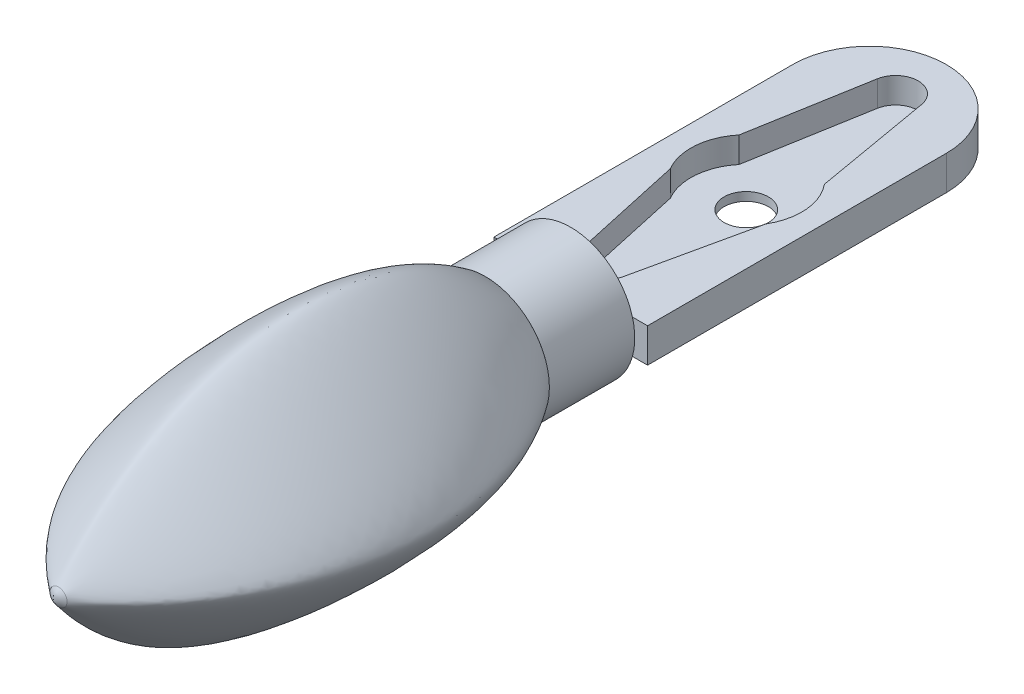
ISO-10303-21;
HEADER;
FILE_DESCRIPTION(('STEP AP214'),'2;1');
FILE_NAME('part.step','',(''),(''),'','','');
FILE_SCHEMA(('AUTOMOTIVE_DESIGN { 1 0 10303 214 1 1 1 1 }'));
ENDSEC;
DATA;
#1=APPLICATION_CONTEXT('core data for automotive mechanical design processes');
#2=APPLICATION_PROTOCOL_DEFINITION('international standard','automotive_design',2000,#1);
#3=PRODUCT_CONTEXT('',#1,'mechanical');
#4=PRODUCT('Part','Part','',(#3));
#5=PRODUCT_RELATED_PRODUCT_CATEGORY('part','',(#4));
#6=PRODUCT_DEFINITION_FORMATION('','',#4);
#7=PRODUCT_DEFINITION_CONTEXT('part definition',#1,'design');
#8=PRODUCT_DEFINITION('design','',#6,#7);
#9=PRODUCT_DEFINITION_SHAPE('','',#8);
#10=(LENGTH_UNIT() NAMED_UNIT(*) SI_UNIT(.MILLI.,.METRE.));
#11=(NAMED_UNIT(*) PLANE_ANGLE_UNIT() SI_UNIT($,.RADIAN.));
#12=(NAMED_UNIT(*) SI_UNIT($,.STERADIAN.) SOLID_ANGLE_UNIT());
#13=UNCERTAINTY_MEASURE_WITH_UNIT(LENGTH_MEASURE(1.E-05),#10,'distance_accuracy_value','');
#14=(GEOMETRIC_REPRESENTATION_CONTEXT(3) GLOBAL_UNCERTAINTY_ASSIGNED_CONTEXT((#13)) GLOBAL_UNIT_ASSIGNED_CONTEXT((#10,
#11,#12)) REPRESENTATION_CONTEXT('',''));
#15=CARTESIAN_POINT('',(0.,0.,0.));
#16=DIRECTION('',(0.,0.,1.));
#17=DIRECTION('',(1.,0.,0.));
#18=AXIS2_PLACEMENT_3D('',#15,#16,#17);
#19=CARTESIAN_POINT('',(10.0199999018431,-3.02000028851811,59.6713058607412));
#20=CARTESIAN_POINT('',(10.0200000172503,-2.61200028851814,59.9359846592579));
#21=CARTESIAN_POINT('',(10.0200001326576,-2.20400028851817,60.045061782606));
#22=CARTESIAN_POINT('',(10.0200002480648,-1.79600028851819,60.045285434479));
#23=CARTESIAN_POINT('',(10.0200003634721,-1.38800028851822,59.9358519810749));
#24=CARTESIAN_POINT('',(10.0200004788793,-0.980000288518246,59.6719841276044));
#25=CARTESIAN_POINT('',(9.81599986377084,-3.02000023081447,59.7611798395393));
#26=CARTESIAN_POINT('',(9.81599997917809,-2.6120002308145,60.0530891284426));
#27=CARTESIAN_POINT('',(9.81600009458533,-2.20400023081453,60.1740586836226));
#28=CARTESIAN_POINT('',(9.81600020999258,-1.79600023081456,60.1746436779478));
#29=CARTESIAN_POINT('',(9.81600032539983,-1.38800023081459,60.0526005432592));
#30=CARTESIAN_POINT('',(9.81600044080708,-0.980000230814612,59.7615503660819));
#31=CARTESIAN_POINT('',(9.6119998256986,-3.02000017311084,59.8452729788772));
#32=CARTESIAN_POINT('',(9.61199994110584,-2.61200017311087,60.1662060321596));
#33=CARTESIAN_POINT('',(9.61200005651309,-2.2040001731109,60.2976076752485));
#34=CARTESIAN_POINT('',(9.61200017192034,-1.79600017311093,60.2987751637316));
#35=CARTESIAN_POINT('',(9.61200028732759,-1.38800017311095,60.1652899757582));
#36=CARTESIAN_POINT('',(9.61200040273484,-0.980000173110978,59.8454013997782));
#37=CARTESIAN_POINT('',(9.40799978762636,-3.0200001154072,59.9296887772695));
#38=CARTESIAN_POINT('',(9.40799990303361,-2.61200011540723,60.2950514761496));
#39=CARTESIAN_POINT('',(9.40800001844085,-2.20400011540726,60.4217271542177));
#40=CARTESIAN_POINT('',(9.4080001338481,-1.79600011540729,60.4215732040455));
#41=CARTESIAN_POINT('',(9.40800024925534,-1.38800011540732,60.2943340917807));
#42=CARTESIAN_POINT('',(9.4080003646626,-0.980000115407343,59.9303294263708));
#43=CARTESIAN_POINT('',(9.16319973224945,-3.02000004616284,59.9906751110089));
#44=CARTESIAN_POINT('',(9.16319984765669,-2.61200004616287,60.4066717478284));
#45=CARTESIAN_POINT('',(9.16319996306394,-2.2040000461629,60.4769060065083));
#46=CARTESIAN_POINT('',(9.16320007847118,-1.79600004616293,60.4823320662432));
#47=CARTESIAN_POINT('',(9.16320019387844,-1.38800004616296,60.4039379670143));
#48=CARTESIAN_POINT('',(9.16320030928569,-0.98000004616298,59.9913886654708));
#49=CARTESIAN_POINT('',(8.91839967687254,-3.01999997691847,59.9786981725399));
#50=CARTESIAN_POINT('',(8.91839979227978,-2.61199997691851,60.3861826542139));
#51=CARTESIAN_POINT('',(8.91839990768704,-2.20399997691853,60.4648540857779));
#52=CARTESIAN_POINT('',(8.91840002309428,-1.79599997691856,60.469162877881));
#53=CARTESIAN_POINT('',(8.91840013850153,-1.38799997691859,60.3839262392396));
#54=CARTESIAN_POINT('',(8.91840025390878,-0.979999976918615,59.9793096431932));
#55=CARTESIAN_POINT('',(8.87759965956787,-3.01999996537775,59.9747084966445));
#56=CARTESIAN_POINT('',(8.87759977497512,-2.61199996537778,60.3791442810936));
#57=CARTESIAN_POINT('',(8.87759989038237,-2.2039999653778,60.4608992058125));
#58=CARTESIAN_POINT('',(8.87760000578961,-1.79599996537783,60.4649246894336));
#59=CARTESIAN_POINT('',(8.87760012119686,-1.38799996537786,60.376982972844));
#60=CARTESIAN_POINT('',(8.87760023660411,-0.979999965377885,59.9753186031182));
#61=CARTESIAN_POINT('',(8.67359962155773,-3.01999990767411,59.9460763977806));
#62=CARTESIAN_POINT('',(8.67359973696498,-2.61199990767414,60.3289409771327));
#63=CARTESIAN_POINT('',(8.67359985237222,-2.20399990767417,60.4302764471199));
#64=CARTESIAN_POINT('',(8.67359996777947,-1.7959999076742,60.4326465825806));
#65=CARTESIAN_POINT('',(8.67360008318672,-1.38799990767423,60.3273728719974));
#66=CARTESIAN_POINT('',(8.67360019859397,-0.97999990767425,59.946609425415));
#67=CARTESIAN_POINT('',(8.46959958354759,-3.01999984997047,59.8788246496406));
#68=CARTESIAN_POINT('',(8.46959969895483,-2.61199984997051,60.2166602439782));
#69=CARTESIAN_POINT('',(8.46959981436209,-2.20399984997054,60.3454706333419));
#70=CARTESIAN_POINT('',(8.46959992976933,-1.79599984997056,60.346190582432));
#71=CARTESIAN_POINT('',(8.46960004517658,-1.38799984997059,60.2158152865172));
#72=CARTESIAN_POINT('',(8.46960016058383,-0.979999849970615,59.8790348028657));
#73=CARTESIAN_POINT('',(8.30639956284212,-3.01999980380757,59.8139327161403));
#74=CARTESIAN_POINT('',(8.30639967824936,-2.6119998038076,60.1215715258685));
#75=CARTESIAN_POINT('',(8.30639979365661,-2.20399980380763,60.2474553097653));
#76=CARTESIAN_POINT('',(8.30639990906386,-1.79599980380766,60.2482160852123));
#77=CARTESIAN_POINT('',(8.30640002447111,-1.38799980380768,60.1209693720613));
#78=CARTESIAN_POINT('',(8.30640013987836,-0.979999803807709,59.814286482078));
#79=CARTESIAN_POINT('',(8.14319954213664,-3.01999975764466,59.7444310830504));
#80=CARTESIAN_POINT('',(8.14319965754389,-2.61199975764469,60.0289009097591));
#81=CARTESIAN_POINT('',(8.14319977295114,-2.20399975764472,60.1489646147589));
#82=CARTESIAN_POINT('',(8.14319988835838,-1.79599975764475,60.1492234588359));
#83=CARTESIAN_POINT('',(8.14320000376564,-1.38799975764478,60.0285716534876));
#84=CARTESIAN_POINT('',(8.14320011917289,-0.979999757644803,59.7450099194435));
#85=CARTESIAN_POINT('',(7.97999952143117,-3.01999971148176,59.6710188183758));
#86=CARTESIAN_POINT('',(7.97999963683842,-2.61199971148179,59.9342651427469));
#87=CARTESIAN_POINT('',(7.97999975224567,-2.20399971148182,60.0461448055459));
#88=CARTESIAN_POINT('',(7.97999986765291,-1.79599971148184,60.0460081890795));
#89=CARTESIAN_POINT('',(7.97999998306017,-1.38799971148187,59.9341338749382));
#90=CARTESIAN_POINT('',(7.98000009846741,-0.979999711481898,59.6718461034298));
#91=B_SPLINE_SURFACE_WITH_KNOTS('',5,5,((#19,#20,#21,#22,#23,#24),(#25,#26,#27,#28,#29,#30),
(#31,#32,#33,#34,#35,#36),(#37,#38,#39,#40,#41,#42),(#43,#44,#45,#46,#47,#48),(#49,#50,#51,#52,
#53,#54),(#55,#56,#57,#58,#59,#60),(#61,#62,#63,#64,#65,#66),(#67,#68,#69,#70,#71,#72),(#73,#74,
#75,#76,#77,#78),(#79,#80,#81,#82,#83,#84),(#85,#86,#87,#88,#89,#90)),.UNSPECIFIED.,.F.,.F.,.F.,
(6,3,3,6),(6,6),(-1.02000024710375,-5.67425053610293E-08,0.204000029780841,1.02000013330824),
(-1.02000000041239,1.01999999958755),.UNSPECIFIED.);
#92=CARTESIAN_POINT('',(9.,-3.00000000000001,60.));
#93=CARTESIAN_POINT('',(8.86910030695214,-3.00000000000001,60.));
#94=CARTESIAN_POINT('',(8.60734891089191,-2.947991074474,60.));
#95=CARTESIAN_POINT('',(8.27446701565593,-2.72553298434406,59.9999999999999));
#96=CARTESIAN_POINT('',(8.05200892552601,-2.39265108910809,60.0000000000001));
#97=CARTESIAN_POINT('',(7.99999999999999,-2.13089969304786,60.));
#98=CARTESIAN_POINT('',(7.99999999999999,-1.86910030695214,60.));
#99=CARTESIAN_POINT('',(8.05200892552601,-1.60734891089191,60.0000000000001));
#100=CARTESIAN_POINT('',(8.27446701565593,-1.27446701565593,59.9999999999998));
#101=CARTESIAN_POINT('',(8.60734891089192,-1.052008925526,60.0000000000001));
#102=CARTESIAN_POINT('',(8.86910030695214,-0.999999999999993,60.));
#103=CARTESIAN_POINT('',(9.13089969304786,-0.999999999999993,60.));
#104=CARTESIAN_POINT('',(9.39265108910809,-1.052008925526,60.));
#105=CARTESIAN_POINT('',(9.72553298434406,-1.27446701565593,60.));
#106=CARTESIAN_POINT('',(9.947991074474,-1.60734891089191,60.0000000000001));
#107=CARTESIAN_POINT('',(10.,-1.86910030695214,60.));
#108=CARTESIAN_POINT('',(10.,-2.13089969304786,60.));
#109=CARTESIAN_POINT('',(9.94799107447399,-2.39265108910809,60.));
#110=CARTESIAN_POINT('',(9.72553298434407,-2.72553298434407,60.));
#111=CARTESIAN_POINT('',(9.39265108910808,-2.947991074474,60.));
#112=CARTESIAN_POINT('',(9.13089969304786,-3.00000000000001,60.));
#113=CARTESIAN_POINT('',(9.,-3.00000000000001,60.));
#114=B_SPLINE_CURVE_WITH_KNOTS('',3,(#92,#93,#94,#95,#96,#97,#98,#99,#100,#101,#102,#103,#104,
#105,#106,#107,#108,#109,#110,#111,#112,#113),.UNSPECIFIED.,.T.,.F.,(4,1,1,1,2,1,1,1,2,1,1,1,2,
1,1,1,4),(0.,0.0625,0.125,0.1875,0.25,0.3125,0.375,0.4375,0.5,0.5625,0.625,0.6875,0.75,0.8125,
0.875,0.9375,1.),.UNSPECIFIED.);
#115=CARTESIAN_POINT('',(9.,-3.00000000000001,60.));
#116=VERTEX_POINT('',#115);
#117=EDGE_CURVE('E141',#116,#116,#114,.T.);
#118=ORIENTED_EDGE('',*,*,#117,.F.);
#119=EDGE_LOOP('',(#118));
#120=FACE_BOUND('',#119,.T.);
#121=ADVANCED_FACE('F128',(#120),#91,.F.);
#122=CARTESIAN_POINT('',(9.,5.5,10.));
#123=DIRECTION('',(0.,0.,-1.));
#124=DIRECTION('',(0.,1.,0.));
#125=AXIS2_PLACEMENT_3D('',#122,#123,#124);
#126=PLANE('',#125);
#127=CARTESIAN_POINT('',(9.,-9.5,10.));
#128=CARTESIAN_POINT('',(9.98174769785895,-9.5,10.));
#129=CARTESIAN_POINT('',(11.9449156493394,-9.10992505068653,10.));
#130=CARTESIAN_POINT('',(14.4414893574974,-7.44148935749734,9.99999999999998));
#131=CARTESIAN_POINT('',(16.1099250506865,-4.94491564933942,10.));
#132=CARTESIAN_POINT('',(16.5,-2.98174769785896,10.));
#133=CARTESIAN_POINT('',(16.5,-1.01825230214104,10.));
#134=CARTESIAN_POINT('',(16.1099250506865,0.944915649339421,10.));
#135=CARTESIAN_POINT('',(14.4414893574973,3.44148935749733,9.99999999999998));
#136=CARTESIAN_POINT('',(11.9449156493394,5.10992505068653,10.));
#137=CARTESIAN_POINT('',(9.98174769785895,5.5,10.));
#138=CARTESIAN_POINT('',(8.01825230214104,5.5,10.));
#139=CARTESIAN_POINT('',(6.05508435066059,5.10992505068652,10.));
#140=CARTESIAN_POINT('',(3.55851064250266,3.44148935749734,9.99999999999998));
#141=CARTESIAN_POINT('',(1.89007494931348,0.94491564933942,10.));
#142=CARTESIAN_POINT('',(1.5,-1.01825230214104,10.));
#143=CARTESIAN_POINT('',(1.5,-2.98174769785896,10.));
#144=CARTESIAN_POINT('',(1.89007494931348,-4.94491564933941,10.));
#145=CARTESIAN_POINT('',(3.55851064250266,-7.44148935749735,9.99999999999999));
#146=CARTESIAN_POINT('',(6.05508435066059,-9.10992505068652,10.));
#147=CARTESIAN_POINT('',(8.01825230214104,-9.5,10.));
#148=CARTESIAN_POINT('',(9.,-9.5,10.));
#149=B_SPLINE_CURVE_WITH_KNOTS('',3,(#127,#128,#129,#130,#131,#132,#133,#134,#135,#136,#137,
#138,#139,#140,#141,#142,#143,#144,#145,#146,#147,#148),.UNSPECIFIED.,.T.,.F.,(4,1,1,1,2,1,1,1,
2,1,1,1,2,1,1,1,4),(0.,0.0625,0.125,0.1875,0.25,0.3125,0.375,0.4375,0.5,0.5625,0.625,0.6875,
0.75,0.8125,0.875,0.9375,1.),.UNSPECIFIED.);
#150=CARTESIAN_POINT('',(9.,-9.5,10.));
#151=VERTEX_POINT('',#150);
#152=EDGE_CURVE('E13',#151,#151,#149,.T.);
#153=ORIENTED_EDGE('',*,*,#152,.F.);
#154=EDGE_LOOP('',(#153));
#155=FACE_BOUND('',#154,.T.);
#156=ADVANCED_FACE('F167',(#155),#126,.T.);
#157=CARTESIAN_POINT('',(9.,-9.5,10.));
#158=CARTESIAN_POINT('',(9.,-13.3872736073307,14.9789819894649));
#159=CARTESIAN_POINT('',(9.,-17.0648639396607,23.7681084370191));
#160=CARTESIAN_POINT('',(9.,-17.1229033941333,36.4134774412373));
#161=CARTESIAN_POINT('',(9.,-13.8336374596375,48.6236967448897));
#162=CARTESIAN_POINT('',(9.,-8.03108860323303,56.1804050979084));
#163=CARTESIAN_POINT('',(9.,-3.00000000000001,60.));
#164=CARTESIAN_POINT('',(9.98174769785895,-9.5,10.));
#165=CARTESIAN_POINT('',(9.88720903065772,-13.3872736073307,14.9789819894649));
#166=CARTESIAN_POINT('',(9.74540102985588,-17.0648639396607,23.7681084370191));
#167=CARTESIAN_POINT('',(9.55632369545341,-17.1229033941333,36.4134774412373));
#168=CARTESIAN_POINT('',(9.36724636105095,-13.8336374596375,48.6236967448897));
#169=CARTESIAN_POINT('',(9.22543836024909,-8.03108860323303,56.1804050979084));
#170=CARTESIAN_POINT('',(9.13089969304786,-3.00000000000001,60.));
#171=CARTESIAN_POINT('',(11.9449156493394,-9.10992505068653,10.));
#172=CARTESIAN_POINT('',(12.2375176768967,-12.458574570855,14.9789819894649));
#173=CARTESIAN_POINT('',(12.4072557083994,-15.597393782275,23.7681084370192));
#174=CARTESIAN_POINT('',(12.0278962934904,-15.5427485324469,36.4134774412373));
#175=CARTESIAN_POINT('',(11.2301237049604,-12.5592110672714,48.6236967448897));
#176=CARTESIAN_POINT('',(10.2148443378712,-7.40290848854873,56.1804050979084));
#177=CARTESIAN_POINT('',(9.39265108910808,-2.947991074474,60.));
#178=CARTESIAN_POINT('',(14.4414893574974,-7.44148935749734,9.99999999999998));
#179=CARTESIAN_POINT('',(16.2222421197012,-9.2222421197012,14.9789819894649));
#180=CARTESIAN_POINT('',(17.816711223674,-10.816711223674,23.7681084370191));
#181=CARTESIAN_POINT('',(17.5199628679874,-10.5199628679874,36.4134774412373));
#182=CARTESIAN_POINT('',(15.5495618178165,-8.54956181781652,48.6236967448896));
#183=CARTESIAN_POINT('',(12.4039613274221,-5.40396132742205,56.1804050979083));
#184=CARTESIAN_POINT('',(9.72553298434407,-2.72553298434407,60.));
#185=CARTESIAN_POINT('',(16.1099250506865,-4.94491564933942,10.));
#186=CARTESIAN_POINT('',(19.458574570855,-5.23751767689672,14.9789819894649));
#187=CARTESIAN_POINT('',(22.597393782275,-5.40725570839941,23.7681084370192));
#188=CARTESIAN_POINT('',(22.5427485324469,-5.02789629349042,36.4134774412373));
#189=CARTESIAN_POINT('',(19.5592110672714,-4.23012370496037,48.6236967448897));
#190=CARTESIAN_POINT('',(14.4029084885487,-3.21484433787125,56.1804050979084));
#191=CARTESIAN_POINT('',(9.94799107447399,-2.39265108910809,60.));
#192=CARTESIAN_POINT('',(16.5,-2.98174769785896,10.));
#193=CARTESIAN_POINT('',(20.3872736073306,-2.88720903065772,14.9789819894649));
#194=CARTESIAN_POINT('',(24.0648639396607,-2.74540102985587,23.7681084370191));
#195=CARTESIAN_POINT('',(24.1229033941333,-2.55632369545341,36.4134774412373));
#196=CARTESIAN_POINT('',(20.8336374596375,-2.36724636105094,48.6236967448897));
#197=CARTESIAN_POINT('',(15.031088603233,-2.22543836024909,56.1804050979084));
#198=CARTESIAN_POINT('',(10.,-2.13089969304786,60.));
#199=CARTESIAN_POINT('',(16.5,-1.01825230214104,10.));
#200=CARTESIAN_POINT('',(20.3872736073306,-1.11279096934228,14.9789819894649));
#201=CARTESIAN_POINT('',(24.0648639396607,-1.25459897014413,23.7681084370191));
#202=CARTESIAN_POINT('',(24.1229033941333,-1.44367630454659,36.4134774412373));
#203=CARTESIAN_POINT('',(20.8336374596375,-1.63275363894906,48.6236967448897));
#204=CARTESIAN_POINT('',(15.031088603233,-1.77456163975091,56.1804050979084));
#205=CARTESIAN_POINT('',(10.,-1.86910030695214,60.));
#206=CARTESIAN_POINT('',(16.1099250506865,0.944915649339421,10.));
#207=CARTESIAN_POINT('',(19.458574570855,1.23751767689672,14.9789819894649));
#208=CARTESIAN_POINT('',(22.597393782275,1.40725570839942,23.7681084370192));
#209=CARTESIAN_POINT('',(22.5427485324469,1.02789629349042,36.4134774412374));
#210=CARTESIAN_POINT('',(19.5592110672714,0.230123704960372,48.6236967448897));
#211=CARTESIAN_POINT('',(14.4029084885487,-0.785155662128749,56.1804050979084));
#212=CARTESIAN_POINT('',(9.947991074474,-1.60734891089191,60.0000000000001));
#213=CARTESIAN_POINT('',(14.4414893574973,3.44148935749733,9.99999999999998));
#214=CARTESIAN_POINT('',(16.2222421197012,5.2222421197012,14.9789819894649));
#215=CARTESIAN_POINT('',(17.816711223674,6.81671122367401,23.7681084370191));
#216=CARTESIAN_POINT('',(17.5199628679873,6.51996286798737,36.4134774412373));
#217=CARTESIAN_POINT('',(15.5495618178165,4.54956181781652,48.6236967448896));
#218=CARTESIAN_POINT('',(12.403961327422,1.40396132742205,56.1804050979083));
#219=CARTESIAN_POINT('',(9.72553298434406,-1.27446701565593,60.));
#220=CARTESIAN_POINT('',(11.9449156493394,5.10992505068653,10.));
#221=CARTESIAN_POINT('',(12.2375176768967,8.45857457085503,14.9789819894649));
#222=CARTESIAN_POINT('',(12.4072557083994,11.5973937822751,23.7681084370192));
#223=CARTESIAN_POINT('',(12.0278962934904,11.5427485324469,36.4134774412373));
#224=CARTESIAN_POINT('',(11.2301237049604,8.55921106727144,48.6236967448897));
#225=CARTESIAN_POINT('',(10.2148443378713,3.40290848854873,56.1804050979084));
#226=CARTESIAN_POINT('',(9.39265108910809,-1.052008925526,60.));
#227=CARTESIAN_POINT('',(9.98174769785895,5.5,10.));
#228=CARTESIAN_POINT('',(9.88720903065772,9.38727360733067,14.9789819894649));
#229=CARTESIAN_POINT('',(9.74540102985588,13.0648639396607,23.7681084370192));
#230=CARTESIAN_POINT('',(9.55632369545341,13.1229033941334,36.4134774412373));
#231=CARTESIAN_POINT('',(9.36724636105095,9.83363745963754,48.6236967448897));
#232=CARTESIAN_POINT('',(9.22543836024909,4.03108860323302,56.1804050979084));
#233=CARTESIAN_POINT('',(9.13089969304786,-0.999999999999993,60.));
#234=CARTESIAN_POINT('',(8.01825230214104,5.5,10.));
#235=CARTESIAN_POINT('',(8.11279096934227,9.38727360733067,14.9789819894649));
#236=CARTESIAN_POINT('',(8.25459897014413,13.0648639396607,23.7681084370192));
#237=CARTESIAN_POINT('',(8.44367630454659,13.1229033941334,36.4134774412373));
#238=CARTESIAN_POINT('',(8.63275363894906,9.83363745963754,48.6236967448897));
#239=CARTESIAN_POINT('',(8.7745616397509,4.03108860323302,56.1804050979084));
#240=CARTESIAN_POINT('',(8.86910030695214,-0.999999999999993,60.));
#241=CARTESIAN_POINT('',(6.05508435066059,5.10992505068652,10.));
#242=CARTESIAN_POINT('',(5.76248232310329,8.45857457085503,14.978981989465));
#243=CARTESIAN_POINT('',(5.5927442916006,11.5973937822751,23.7681084370192));
#244=CARTESIAN_POINT('',(5.97210370650959,11.5427485324469,36.4134774412374));
#245=CARTESIAN_POINT('',(6.76987629503964,8.55921106727143,48.6236967448898));
#246=CARTESIAN_POINT('',(7.78515566212876,3.40290848854873,56.1804050979085));
#247=CARTESIAN_POINT('',(8.60734891089192,-1.052008925526,60.0000000000001));
#248=CARTESIAN_POINT('',(3.55851064250266,3.44148935749734,9.99999999999998));
#249=CARTESIAN_POINT('',(1.7777578802988,5.2222421197012,14.9789819894649));
#250=CARTESIAN_POINT('',(0.183288776326013,6.81671122367401,23.7681084370191));
#251=CARTESIAN_POINT('',(0.480037132012637,6.51996286798738,36.4134774412372));
#252=CARTESIAN_POINT('',(2.45043818218349,4.54956181781652,48.6236967448895));
#253=CARTESIAN_POINT('',(5.59603867257794,1.40396132742205,56.1804050979082));
#254=CARTESIAN_POINT('',(8.27446701565593,-1.27446701565593,59.9999999999998));
#255=CARTESIAN_POINT('',(1.89007494931348,0.94491564933942,10.));
#256=CARTESIAN_POINT('',(-1.45857457085501,1.23751767689672,14.9789819894649));
#257=CARTESIAN_POINT('',(-4.59739378227501,1.40725570839942,23.7681084370192));
#258=CARTESIAN_POINT('',(-4.5427485324469,1.02789629349042,36.4134774412374));
#259=CARTESIAN_POINT('',(-1.5592110672714,0.23012370496037,48.6236967448897));
#260=CARTESIAN_POINT('',(3.59709151145128,-0.785155662128749,56.1804050979084));
#261=CARTESIAN_POINT('',(8.05200892552601,-1.60734891089191,60.0000000000001));
#262=CARTESIAN_POINT('',(1.5,-1.01825230214104,10.));
#263=CARTESIAN_POINT('',(-2.38727360733066,-1.11279096934228,14.9789819894649));
#264=CARTESIAN_POINT('',(-6.06486393966067,-1.25459897014413,23.7681084370191));
#265=CARTESIAN_POINT('',(-6.12290339413331,-1.44367630454659,36.4134774412373));
#266=CARTESIAN_POINT('',(-2.83363745963751,-1.63275363894906,48.6236967448897));
#267=CARTESIAN_POINT('',(2.96891139676698,-1.77456163975091,56.1804050979083));
#268=CARTESIAN_POINT('',(7.99999999999999,-1.86910030695214,60.));
#269=CARTESIAN_POINT('',(1.5,-2.98174769785896,10.));
#270=CARTESIAN_POINT('',(-2.38727360733066,-2.88720903065772,14.9789819894649));
#271=CARTESIAN_POINT('',(-6.06486393966067,-2.74540102985587,23.7681084370191));
#272=CARTESIAN_POINT('',(-6.12290339413331,-2.55632369545341,36.4134774412373));
#273=CARTESIAN_POINT('',(-2.83363745963751,-2.36724636105094,48.6236967448897));
#274=CARTESIAN_POINT('',(2.96891139676698,-2.22543836024909,56.1804050979083));
#275=CARTESIAN_POINT('',(7.99999999999999,-2.13089969304786,60.));
#276=CARTESIAN_POINT('',(1.89007494931348,-4.94491564933941,10.));
#277=CARTESIAN_POINT('',(-1.45857457085501,-5.23751767689671,14.9789819894649));
#278=CARTESIAN_POINT('',(-4.59739378227501,-5.40725570839941,23.7681084370192));
#279=CARTESIAN_POINT('',(-4.5427485324469,-5.02789629349042,36.4134774412374));
#280=CARTESIAN_POINT('',(-1.5592110672714,-4.23012370496037,48.6236967448897));
#281=CARTESIAN_POINT('',(3.59709151145129,-3.21484433787126,56.1804050979084));
#282=CARTESIAN_POINT('',(8.05200892552601,-2.39265108910809,60.0000000000001));
#283=CARTESIAN_POINT('',(3.55851064250266,-7.44148935749735,9.99999999999999));
#284=CARTESIAN_POINT('',(1.7777578802988,-9.2222421197012,14.9789819894649));
#285=CARTESIAN_POINT('',(0.183288776326013,-10.816711223674,23.7681084370191));
#286=CARTESIAN_POINT('',(0.480037132012639,-10.5199628679874,36.4134774412373));
#287=CARTESIAN_POINT('',(2.45043818218349,-8.54956181781652,48.6236967448896));
#288=CARTESIAN_POINT('',(5.59603867257795,-5.40396132742205,56.1804050979083));
#289=CARTESIAN_POINT('',(8.27446701565593,-2.72553298434406,59.9999999999999));
#290=CARTESIAN_POINT('',(6.05508435066059,-9.10992505068652,10.));
#291=CARTESIAN_POINT('',(5.76248232310329,-12.458574570855,14.9789819894649));
#292=CARTESIAN_POINT('',(5.5927442916006,-15.597393782275,23.7681084370192));
#293=CARTESIAN_POINT('',(5.97210370650959,-15.5427485324469,36.4134774412373));
#294=CARTESIAN_POINT('',(6.76987629503964,-12.5592110672714,48.6236967448897));
#295=CARTESIAN_POINT('',(7.78515566212875,-7.40290848854873,56.1804050979084));
#296=CARTESIAN_POINT('',(8.60734891089191,-2.947991074474,60.));
#297=CARTESIAN_POINT('',(8.01825230214104,-9.5,10.));
#298=CARTESIAN_POINT('',(8.11279096934227,-13.3872736073307,14.9789819894649));
#299=CARTESIAN_POINT('',(8.25459897014413,-17.0648639396607,23.7681084370191));
#300=CARTESIAN_POINT('',(8.44367630454659,-17.1229033941333,36.4134774412373));
#301=CARTESIAN_POINT('',(8.63275363894906,-13.8336374596375,48.6236967448897));
#302=CARTESIAN_POINT('',(8.7745616397509,-8.03108860323303,56.1804050979084));
#303=CARTESIAN_POINT('',(8.86910030695214,-3.00000000000001,60.));
#304=CARTESIAN_POINT('',(9.,-9.5,10.));
#305=CARTESIAN_POINT('',(9.,-13.3872736073307,14.9789819894649));
#306=CARTESIAN_POINT('',(9.,-17.0648639396607,23.7681084370191));
#307=CARTESIAN_POINT('',(9.,-17.1229033941333,36.4134774412373));
#308=CARTESIAN_POINT('',(9.,-13.8336374596375,48.6236967448897));
#309=CARTESIAN_POINT('',(9.,-8.03108860323303,56.1804050979084));
#310=CARTESIAN_POINT('',(9.,-3.00000000000001,60.));
#311=B_SPLINE_SURFACE_WITH_KNOTS('',3,3,((#157,#158,#159,#160,#161,#162,#163),(#164,#165,#166,
#167,#168,#169,#170),(#171,#172,#173,#174,#175,#176,#177),(#178,#179,#180,#181,#182,#183,#184),
(#185,#186,#187,#188,#189,#190,#191),(#192,#193,#194,#195,#196,#197,#198),(#199,#200,#201,#202,
#203,#204,#205),(#206,#207,#208,#209,#210,#211,#212),(#213,#214,#215,#216,#217,#218,#219),(#220,
#221,#222,#223,#224,#225,#226),(#227,#228,#229,#230,#231,#232,#233),(#234,#235,#236,#237,#238,
#239,#240),(#241,#242,#243,#244,#245,#246,#247),(#248,#249,#250,#251,#252,#253,#254),(#255,#256,
#257,#258,#259,#260,#261),(#262,#263,#264,#265,#266,#267,#268),(#269,#270,#271,#272,#273,#274,
#275),(#276,#277,#278,#279,#280,#281,#282),(#283,#284,#285,#286,#287,#288,#289),(#290,#291,#292,
#293,#294,#295,#296),(#297,#298,#299,#300,#301,#302,#303),(#304,#305,#306,#307,#308,#309,#310)),
.UNSPECIFIED.,.T.,.F.,.F.,(4,1,1,1,2,1,1,1,2,1,1,1,2,1,1,1,4),(4,1,1,1,4),(0.,0.0625,0.125,
0.1875,0.25,0.3125,0.375,0.4375,0.5,0.5625,0.625,0.6875,0.75,0.8125,0.875,0.9375,1.),(0.,
0.333333333333333,0.5,0.666666666666667,1.),.UNSPECIFIED.);
#312=ORIENTED_EDGE('',*,*,#152,.T.);
#313=EDGE_LOOP('',(#312));
#314=FACE_BOUND('',#313,.T.);
#315=ORIENTED_EDGE('',*,*,#117,.T.);
#316=EDGE_LOOP('',(#315));
#317=FACE_BOUND('',#316,.T.);
#318=ADVANCED_FACE('F165',(#314,#317),#311,.T.);
#319=CLOSED_SHELL('',(#121,#156,#318));
#320=MANIFOLD_SOLID_BREP('B2',#319);
#321=CARTESIAN_POINT('',(18.,-4.,0.));
#322=DIRECTION('',(0.,0.,-1.));
#323=DIRECTION('',(-1.,0.,0.));
#324=AXIS2_PLACEMENT_3D('',#321,#322,#323);
#325=PLANE('',#324);
#326=CARTESIAN_POINT('',(9.,-2.,0.));
#327=DIRECTION('',(0.,0.,1.));
#328=DIRECTION('',(1.,0.,0.));
#329=AXIS2_PLACEMENT_3D('',#326,#327,#328);
#330=CIRCLE('',#329,7.5);
#331=CARTESIAN_POINT('',(1.77158385259952,0.,0.));
#332=VERTEX_POINT('',#331);
#333=CARTESIAN_POINT('',(1.77158385259952,-4.,0.));
#334=VERTEX_POINT('',#333);
#335=EDGE_CURVE('E126',#332,#334,#330,.T.);
#336=ORIENTED_EDGE('',*,*,#335,.F.);
#337=DIRECTION('',(-1.,0.,0.));
#338=VECTOR('',#337,1.);
#339=CARTESIAN_POINT('',(18.,0.,0.));
#340=LINE('',#339,#338);
#341=CARTESIAN_POINT('',(0.,0.,0.));
#342=VERTEX_POINT('',#341);
#343=EDGE_CURVE('E333',#332,#342,#340,.T.);
#344=ORIENTED_EDGE('',*,*,#343,.T.);
#345=DIRECTION('',(0.,1.,0.));
#346=VECTOR('',#345,1.);
#347=CARTESIAN_POINT('',(0.,-4.,0.));
#348=LINE('',#347,#346);
#349=CARTESIAN_POINT('',(0.,-4.,0.));
#350=VERTEX_POINT('',#349);
#351=EDGE_CURVE('E346',#350,#342,#348,.T.);
#352=ORIENTED_EDGE('',*,*,#351,.F.);
#353=DIRECTION('',(-1.,0.,0.));
#354=VECTOR('',#353,1.);
#355=CARTESIAN_POINT('',(18.,-4.,0.));
#356=LINE('',#355,#354);
#357=EDGE_CURVE('E239',#334,#350,#356,.T.);
#358=ORIENTED_EDGE('',*,*,#357,.F.);
#359=EDGE_LOOP('',(#336,#344,#352,#358));
#360=FACE_BOUND('',#359,.T.);
#361=ADVANCED_FACE('F221',(#360),#325,.F.);
#362=CARTESIAN_POINT('',(16.2284161474005,-4.,0.));
#363=VERTEX_POINT('',#362);
#364=CARTESIAN_POINT('',(16.2284161474005,0.,0.));
#365=VERTEX_POINT('',#364);
#366=EDGE_CURVE('E230',#363,#365,#330,.T.);
#367=ORIENTED_EDGE('',*,*,#366,.F.);
#368=CARTESIAN_POINT('',(18.,-4.,0.));
#369=VERTEX_POINT('',#368);
#370=EDGE_CURVE('E417',#369,#363,#356,.T.);
#371=ORIENTED_EDGE('',*,*,#370,.F.);
#372=DIRECTION('',(0.,1.,0.));
#373=VECTOR('',#372,1.);
#374=CARTESIAN_POINT('',(18.,-4.,0.));
#375=LINE('',#374,#373);
#376=CARTESIAN_POINT('',(18.,0.,0.));
#377=VERTEX_POINT('',#376);
#378=EDGE_CURVE('E327',#369,#377,#375,.T.);
#379=ORIENTED_EDGE('',*,*,#378,.T.);
#380=EDGE_CURVE('E324',#377,#365,#340,.T.);
#381=ORIENTED_EDGE('',*,*,#380,.T.);
#382=EDGE_LOOP('',(#367,#371,#379,#381));
#383=FACE_BOUND('',#382,.T.);
#384=ADVANCED_FACE('F223',(#383),#325,.F.);
#385=CARTESIAN_POINT('',(0.,-4.,0.));
#386=DIRECTION('',(1.,0.,0.));
#387=DIRECTION('',(0.,0.,-1.));
#388=AXIS2_PLACEMENT_3D('',#385,#386,#387);
#389=PLANE('',#388);
#390=DIRECTION('',(0.,0.,-1.));
#391=VECTOR('',#390,1.);
#392=CARTESIAN_POINT('',(0.,0.,0.));
#393=LINE('',#392,#391);
#394=CARTESIAN_POINT('',(0.,0.,-35.));
#395=VERTEX_POINT('',#394);
#396=EDGE_CURVE('E330',#342,#395,#393,.T.);
#397=ORIENTED_EDGE('',*,*,#396,.T.);
#398=DIRECTION('',(0.,1.,0.));
#399=VECTOR('',#398,1.);
#400=CARTESIAN_POINT('',(0.,-4.,-35.));
#401=LINE('',#400,#399);
#402=CARTESIAN_POINT('',(0.,-4.,-35.));
#403=VERTEX_POINT('',#402);
#404=EDGE_CURVE('E435',#403,#395,#401,.T.);
#405=ORIENTED_EDGE('',*,*,#404,.F.);
#406=DIRECTION('',(0.,0.,-1.));
#407=VECTOR('',#406,1.);
#408=CARTESIAN_POINT('',(0.,-4.,0.));
#409=LINE('',#408,#407);
#410=EDGE_CURVE('E419',#350,#403,#409,.T.);
#411=ORIENTED_EDGE('',*,*,#410,.F.);
#412=ORIENTED_EDGE('',*,*,#351,.T.);
#413=EDGE_LOOP('',(#397,#405,#411,#412));
#414=FACE_BOUND('',#413,.T.);
#415=ADVANCED_FACE('F440',(#414),#389,.F.);
#416=CARTESIAN_POINT('',(9.,-4.,-35.));
#417=DIRECTION('',(0.,1.,0.));
#418=DIRECTION('',(0.,0.,1.));
#419=AXIS2_PLACEMENT_3D('',#416,#417,#418);
#420=CYLINDRICAL_SURFACE('',#419,9.);
#421=CARTESIAN_POINT('',(9.,0.,-35.));
#422=DIRECTION('',(0.,-1.,0.));
#423=DIRECTION('',(0.,0.,-1.));
#424=AXIS2_PLACEMENT_3D('',#421,#422,#423);
#425=CIRCLE('',#424,9.);
#426=CARTESIAN_POINT('',(18.,0.,-35.));
#427=VERTEX_POINT('',#426);
#428=EDGE_CURVE('E427',#395,#427,#425,.T.);
#429=ORIENTED_EDGE('',*,*,#428,.T.);
#430=DIRECTION('',(0.,1.,0.));
#431=VECTOR('',#430,1.);
#432=CARTESIAN_POINT('',(18.,-4.,-35.));
#433=LINE('',#432,#431);
#434=CARTESIAN_POINT('',(18.,-4.,-35.));
#435=VERTEX_POINT('',#434);
#436=EDGE_CURVE('E432',#435,#427,#433,.T.);
#437=ORIENTED_EDGE('',*,*,#436,.F.);
#438=CARTESIAN_POINT('',(9.,-4.,-35.));
#439=DIRECTION('',(0.,-1.,0.));
#440=DIRECTION('',(0.,0.,-1.));
#441=AXIS2_PLACEMENT_3D('',#438,#439,#440);
#442=CIRCLE('',#441,9.);
#443=EDGE_CURVE('E422',#403,#435,#442,.T.);
#444=ORIENTED_EDGE('',*,*,#443,.F.);
#445=ORIENTED_EDGE('',*,*,#404,.T.);
#446=EDGE_LOOP('',(#429,#437,#444,#445));
#447=FACE_BOUND('',#446,.T.);
#448=ADVANCED_FACE('F445',(#447),#420,.T.);
#449=CARTESIAN_POINT('',(18.,-4.,-35.));
#450=DIRECTION('',(-1.,0.,0.));
#451=DIRECTION('',(0.,0.,1.));
#452=AXIS2_PLACEMENT_3D('',#449,#450,#451);
#453=PLANE('',#452);
#454=DIRECTION('',(0.,0.,1.));
#455=VECTOR('',#454,1.);
#456=CARTESIAN_POINT('',(18.,0.,-35.));
#457=LINE('',#456,#455);
#458=EDGE_CURVE('E429',#427,#377,#457,.T.);
#459=ORIENTED_EDGE('',*,*,#458,.T.);
#460=ORIENTED_EDGE('',*,*,#378,.F.);
#461=DIRECTION('',(0.,0.,1.));
#462=VECTOR('',#461,1.);
#463=CARTESIAN_POINT('',(18.,-4.,-35.));
#464=LINE('',#463,#462);
#465=EDGE_CURVE('E424',#435,#369,#464,.T.);
#466=ORIENTED_EDGE('',*,*,#465,.F.);
#467=ORIENTED_EDGE('',*,*,#436,.T.);
#468=EDGE_LOOP('',(#459,#460,#466,#467));
#469=FACE_BOUND('',#468,.T.);
#470=ADVANCED_FACE('F449',(#469),#453,.F.);
#471=CARTESIAN_POINT('',(9.,-4.,-35.));
#472=DIRECTION('',(0.,-1.,0.));
#473=DIRECTION('',(0.,0.,-1.));
#474=AXIS2_PLACEMENT_3D('',#471,#472,#473);
#475=PLANE('',#474);
#476=CARTESIAN_POINT('',(9.,-4.,-20.5602345410471));
#477=DIRECTION('',(0.,1.,0.));
#478=DIRECTION('',(0.,0.,1.));
#479=AXIS2_PLACEMENT_3D('',#476,#477,#478);
#480=CIRCLE('',#479,2.6);
#481=CARTESIAN_POINT('',(9.,-4.,-17.9602345410471));
#482=VERTEX_POINT('',#481);
#483=EDGE_CURVE('E350',#482,#482,#480,.T.);
#484=ORIENTED_EDGE('',*,*,#483,.T.);
#485=EDGE_LOOP('',(#484));
#486=FACE_BOUND('',#485,.T.);
#487=ORIENTED_EDGE('',*,*,#370,.T.);
#488=EDGE_CURVE('E420',#363,#334,#356,.T.);
#489=ORIENTED_EDGE('',*,*,#488,.T.);
#490=ORIENTED_EDGE('',*,*,#357,.T.);
#491=ORIENTED_EDGE('',*,*,#410,.T.);
#492=ORIENTED_EDGE('',*,*,#443,.T.);
#493=ORIENTED_EDGE('',*,*,#465,.T.);
#494=EDGE_LOOP('',(#487,#489,#490,#491,#492,#493));
#495=FACE_BOUND('',#494,.T.);
#496=ADVANCED_FACE('F451',(#486,#495),#475,.T.);
#497=CARTESIAN_POINT('',(9.,0.,-35.));
#498=DIRECTION('',(0.,-1.,0.));
#499=DIRECTION('',(0.,0.,-1.));
#500=AXIS2_PLACEMENT_3D('',#497,#498,#499);
#501=PLANE('',#500);
#502=DIRECTION('',(-0.171428571428571,0.,0.98519655140381));
#503=VECTOR('',#502,1.);
#504=CARTESIAN_POINT('',(6.4,0.,-38.5062981921595));
#505=LINE('',#504,#503);
#506=CARTESIAN_POINT('',(6.4,0.,-38.5062981921595));
#507=VERTEX_POINT('',#506);
#508=CARTESIAN_POINT('',(4.,0.,-24.7135464725062));
#509=VERTEX_POINT('',#508);
#510=EDGE_CURVE('E381',#507,#509,#505,.T.);
#511=ORIENTED_EDGE('',*,*,#510,.F.);
#512=CARTESIAN_POINT('',(9.,0.,-38.0538866555182));
#513=DIRECTION('',(0.,1.,0.));
#514=DIRECTION('',(0.,0.,1.));
#515=AXIS2_PLACEMENT_3D('',#512,#513,#514);
#516=CIRCLE('',#515,2.63906729707412);
#517=CARTESIAN_POINT('',(11.6,0.,-38.5062981921595));
#518=VERTEX_POINT('',#517);
#519=EDGE_CURVE('E379',#518,#507,#516,.T.);
#520=ORIENTED_EDGE('',*,*,#519,.F.);
#521=DIRECTION('',(0.171428571428572,0.,0.98519655140381));
#522=VECTOR('',#521,1.);
#523=CARTESIAN_POINT('',(11.6,0.,-38.5062981921595));
#524=LINE('',#523,#522);
#525=CARTESIAN_POINT('',(14.,0.,-24.7135464725062));
#526=VERTEX_POINT('',#525);
#527=EDGE_CURVE('E359',#518,#526,#524,.T.);
#528=ORIENTED_EDGE('',*,*,#527,.T.);
#529=CARTESIAN_POINT('',(9.,0.,-20.5602345410471));
#530=DIRECTION('',(0.,1.,0.));
#531=DIRECTION('',(0.,0.,1.));
#532=AXIS2_PLACEMENT_3D('',#529,#530,#531);
#533=CIRCLE('',#532,6.5);
#534=CARTESIAN_POINT('',(14.6028914192137,0.,-17.2651461136295));
#535=VERTEX_POINT('',#534);
#536=EDGE_CURVE('E396',#535,#526,#533,.T.);
#537=ORIENTED_EDGE('',*,*,#536,.F.);
#538=DIRECTION('',(-0.214492244229548,0.,0.976725691873298));
#539=VECTOR('',#538,1.);
#540=CARTESIAN_POINT('',(14.6028914192137,0.,-17.2651461136295));
#541=LINE('',#540,#539);
#542=CARTESIAN_POINT('',(11.6,0.,-3.59098642740331));
#543=VERTEX_POINT('',#542);
#544=EDGE_CURVE('E393',#535,#543,#541,.T.);
#545=ORIENTED_EDGE('',*,*,#544,.T.);
#546=CARTESIAN_POINT('',(9.,0.,-4.16195516472323));
#547=DIRECTION('',(0.,1.,0.));
#548=DIRECTION('',(0.,0.,1.));
#549=AXIS2_PLACEMENT_3D('',#546,#547,#548);
#550=CIRCLE('',#549,2.66195516472323);
#551=CARTESIAN_POINT('',(6.4,0.,-3.59098642740331));
#552=VERTEX_POINT('',#551);
#553=EDGE_CURVE('E390',#552,#543,#550,.T.);
#554=ORIENTED_EDGE('',*,*,#553,.F.);
#555=DIRECTION('',(0.214492244229548,0.,0.976725691873297));
#556=VECTOR('',#555,1.);
#557=CARTESIAN_POINT('',(3.39710858078633,0.,-17.2651461136295));
#558=LINE('',#557,#556);
#559=CARTESIAN_POINT('',(3.39710858078633,0.,-17.2651461136295));
#560=VERTEX_POINT('',#559);
#561=EDGE_CURVE('E387',#560,#552,#558,.T.);
#562=ORIENTED_EDGE('',*,*,#561,.F.);
#563=CARTESIAN_POINT('',(9.,0.,-20.5602345410471));
#564=DIRECTION('',(0.,1.,0.));
#565=DIRECTION('',(0.,0.,1.));
#566=AXIS2_PLACEMENT_3D('',#563,#564,#565);
#567=CIRCLE('',#566,6.5);
#568=EDGE_CURVE('E384',#509,#560,#567,.T.);
#569=ORIENTED_EDGE('',*,*,#568,.F.);
#570=EDGE_LOOP('',(#511,#520,#528,#537,#545,#554,#562,#569));
#571=FACE_BOUND('',#570,.T.);
#572=ORIENTED_EDGE('',*,*,#380,.F.);
#573=ORIENTED_EDGE('',*,*,#458,.F.);
#574=ORIENTED_EDGE('',*,*,#428,.F.);
#575=ORIENTED_EDGE('',*,*,#396,.F.);
#576=ORIENTED_EDGE('',*,*,#343,.F.);
#577=EDGE_CURVE('E331',#365,#332,#340,.T.);
#578=ORIENTED_EDGE('',*,*,#577,.F.);
#579=EDGE_LOOP('',(#572,#573,#574,#575,#576,#578));
#580=FACE_BOUND('',#579,.T.);
#581=ADVANCED_FACE('F336',(#571,#580),#501,.F.);
#582=CARTESIAN_POINT('',(9.,-3.,-38.0538866555182));
#583=DIRECTION('',(0.,1.,0.));
#584=DIRECTION('',(0.,0.,1.));
#585=AXIS2_PLACEMENT_3D('',#582,#583,#584);
#586=CYLINDRICAL_SURFACE('',#585,2.63906729707412);
#587=ORIENTED_EDGE('',*,*,#519,.T.);
#588=DIRECTION('',(0.,1.,0.));
#589=VECTOR('',#588,1.);
#590=CARTESIAN_POINT('',(6.4,-3.,-38.5062981921595));
#591=LINE('',#590,#589);
#592=CARTESIAN_POINT('',(6.4,-3.,-38.5062981921595));
#593=VERTEX_POINT('',#592);
#594=EDGE_CURVE('E378',#593,#507,#591,.T.);
#595=ORIENTED_EDGE('',*,*,#594,.F.);
#596=CARTESIAN_POINT('',(9.,-3.,-38.0538866555182));
#597=DIRECTION('',(0.,1.,0.));
#598=DIRECTION('',(0.,0.,1.));
#599=AXIS2_PLACEMENT_3D('',#596,#597,#598);
#600=CIRCLE('',#599,2.63906729707412);
#601=CARTESIAN_POINT('',(11.6,-3.,-38.5062981921595));
#602=VERTEX_POINT('',#601);
#603=EDGE_CURVE('E355',#602,#593,#600,.T.);
#604=ORIENTED_EDGE('',*,*,#603,.F.);
#605=DIRECTION('',(0.,1.,0.));
#606=VECTOR('',#605,1.);
#607=CARTESIAN_POINT('',(11.6,-3.,-38.5062981921595));
#608=LINE('',#607,#606);
#609=EDGE_CURVE('E401',#602,#518,#608,.T.);
#610=ORIENTED_EDGE('',*,*,#609,.T.);
#611=EDGE_LOOP('',(#587,#595,#604,#610));
#612=FACE_BOUND('',#611,.T.);
#613=ADVANCED_FACE('F482',(#612),#586,.F.);
#614=CARTESIAN_POINT('',(11.6,-3.,-38.5062981921595));
#615=DIRECTION('',(-0.985196551403809,0.,0.171428571428572));
#616=DIRECTION('',(0.171428571428572,0.,0.98519655140381));
#617=AXIS2_PLACEMENT_3D('',#614,#615,#616);
#618=PLANE('',#617);
#619=ORIENTED_EDGE('',*,*,#527,.F.);
#620=ORIENTED_EDGE('',*,*,#609,.F.);
#621=DIRECTION('',(0.171428571428572,0.,0.98519655140381));
#622=VECTOR('',#621,1.);
#623=CARTESIAN_POINT('',(11.6,-3.,-38.5062981921595));
#624=LINE('',#623,#622);
#625=CARTESIAN_POINT('',(14.,-3.,-24.7135464725062));
#626=VERTEX_POINT('',#625);
#627=EDGE_CURVE('E376',#602,#626,#624,.T.);
#628=ORIENTED_EDGE('',*,*,#627,.T.);
#629=DIRECTION('',(0.,1.,0.));
#630=VECTOR('',#629,1.);
#631=CARTESIAN_POINT('',(14.,-3.,-24.7135464725062));
#632=LINE('',#631,#630);
#633=EDGE_CURVE('E403',#626,#526,#632,.T.);
#634=ORIENTED_EDGE('',*,*,#633,.T.);
#635=EDGE_LOOP('',(#619,#620,#628,#634));
#636=FACE_BOUND('',#635,.T.);
#637=ADVANCED_FACE('F489',(#636),#618,.T.);
#638=CARTESIAN_POINT('',(9.,-3.,-20.5602345410471));
#639=DIRECTION('',(0.,1.,0.));
#640=DIRECTION('',(0.,0.,1.));
#641=AXIS2_PLACEMENT_3D('',#638,#639,#640);
#642=CYLINDRICAL_SURFACE('',#641,6.5);
#643=ORIENTED_EDGE('',*,*,#536,.T.);
#644=ORIENTED_EDGE('',*,*,#633,.F.);
#645=CARTESIAN_POINT('',(9.,-3.,-20.5602345410471));
#646=DIRECTION('',(0.,1.,0.));
#647=DIRECTION('',(0.,0.,1.));
#648=AXIS2_PLACEMENT_3D('',#645,#646,#647);
#649=CIRCLE('',#648,6.5);
#650=CARTESIAN_POINT('',(14.6028914192137,-3.,-17.2651461136295));
#651=VERTEX_POINT('',#650);
#652=EDGE_CURVE('E373',#651,#626,#649,.T.);
#653=ORIENTED_EDGE('',*,*,#652,.F.);
#654=DIRECTION('',(0.,1.,0.));
#655=VECTOR('',#654,1.);
#656=CARTESIAN_POINT('',(14.6028914192137,-3.,-17.2651461136295));
#657=LINE('',#656,#655);
#658=EDGE_CURVE('E405',#651,#535,#657,.T.);
#659=ORIENTED_EDGE('',*,*,#658,.T.);
#660=EDGE_LOOP('',(#643,#644,#653,#659));
#661=FACE_BOUND('',#660,.T.);
#662=ADVANCED_FACE('F511',(#661),#642,.F.);
#663=CARTESIAN_POINT('',(14.6028914192137,-3.,-17.2651461136295));
#664=DIRECTION('',(-0.976725691873297,0.,-0.214492244229548));
#665=DIRECTION('',(-0.214492244229548,0.,0.976725691873298));
#666=AXIS2_PLACEMENT_3D('',#663,#664,#665);
#667=PLANE('',#666);
#668=ORIENTED_EDGE('',*,*,#544,.F.);
#669=ORIENTED_EDGE('',*,*,#658,.F.);
#670=DIRECTION('',(-0.214492244229548,0.,0.976725691873298));
#671=VECTOR('',#670,1.);
#672=CARTESIAN_POINT('',(14.6028914192137,-3.,-17.2651461136295));
#673=LINE('',#672,#671);
#674=CARTESIAN_POINT('',(11.6,-3.,-3.59098642740331));
#675=VERTEX_POINT('',#674);
#676=EDGE_CURVE('E371',#651,#675,#673,.T.);
#677=ORIENTED_EDGE('',*,*,#676,.T.);
#678=DIRECTION('',(0.,1.,0.));
#679=VECTOR('',#678,1.);
#680=CARTESIAN_POINT('',(11.6,-3.,-3.59098642740331));
#681=LINE('',#680,#679);
#682=EDGE_CURVE('E407',#675,#543,#681,.T.);
#683=ORIENTED_EDGE('',*,*,#682,.T.);
#684=EDGE_LOOP('',(#668,#669,#677,#683));
#685=FACE_BOUND('',#684,.T.);
#686=ADVANCED_FACE('F507',(#685),#667,.T.);
#687=CARTESIAN_POINT('',(9.,-3.,-4.16195516472323));
#688=DIRECTION('',(0.,1.,0.));
#689=DIRECTION('',(0.,0.,1.));
#690=AXIS2_PLACEMENT_3D('',#687,#688,#689);
#691=CYLINDRICAL_SURFACE('',#690,2.66195516472323);
#692=ORIENTED_EDGE('',*,*,#553,.T.);
#693=ORIENTED_EDGE('',*,*,#682,.F.);
#694=CARTESIAN_POINT('',(9.,-3.,-4.16195516472323));
#695=DIRECTION('',(0.,1.,0.));
#696=DIRECTION('',(0.,0.,1.));
#697=AXIS2_PLACEMENT_3D('',#694,#695,#696);
#698=CIRCLE('',#697,2.66195516472323);
#699=CARTESIAN_POINT('',(6.4,-3.,-3.59098642740331));
#700=VERTEX_POINT('',#699);
#701=EDGE_CURVE('E368',#700,#675,#698,.T.);
#702=ORIENTED_EDGE('',*,*,#701,.F.);
#703=DIRECTION('',(0.,1.,0.));
#704=VECTOR('',#703,1.);
#705=CARTESIAN_POINT('',(6.4,-3.,-3.59098642740331));
#706=LINE('',#705,#704);
#707=EDGE_CURVE('E409',#700,#552,#706,.T.);
#708=ORIENTED_EDGE('',*,*,#707,.T.);
#709=EDGE_LOOP('',(#692,#693,#702,#708));
#710=FACE_BOUND('',#709,.T.);
#711=ADVANCED_FACE('F503',(#710),#691,.F.);
#712=CARTESIAN_POINT('',(3.39710858078633,-3.,-17.2651461136295));
#713=DIRECTION('',(-0.976725691873297,0.,0.214492244229548));
#714=DIRECTION('',(0.214492244229548,0.,0.976725691873297));
#715=AXIS2_PLACEMENT_3D('',#712,#713,#714);
#716=PLANE('',#715);
#717=ORIENTED_EDGE('',*,*,#561,.T.);
#718=ORIENTED_EDGE('',*,*,#707,.F.);
#719=DIRECTION('',(0.214492244229548,0.,0.976725691873297));
#720=VECTOR('',#719,1.);
#721=CARTESIAN_POINT('',(3.39710858078633,-3.,-17.2651461136295));
#722=LINE('',#721,#720);
#723=CARTESIAN_POINT('',(3.39710858078633,-3.,-17.2651461136295));
#724=VERTEX_POINT('',#723);
#725=EDGE_CURVE('E365',#724,#700,#722,.T.);
#726=ORIENTED_EDGE('',*,*,#725,.F.);
#727=DIRECTION('',(0.,1.,0.));
#728=VECTOR('',#727,1.);
#729=CARTESIAN_POINT('',(3.39710858078633,-3.,-17.2651461136295));
#730=LINE('',#729,#728);
#731=EDGE_CURVE('E411',#724,#560,#730,.T.);
#732=ORIENTED_EDGE('',*,*,#731,.T.);
#733=EDGE_LOOP('',(#717,#718,#726,#732));
#734=FACE_BOUND('',#733,.T.);
#735=ADVANCED_FACE('F499',(#734),#716,.F.);
#736=CARTESIAN_POINT('',(9.,-3.,-20.5602345410471));
#737=DIRECTION('',(0.,1.,0.));
#738=DIRECTION('',(0.,0.,1.));
#739=AXIS2_PLACEMENT_3D('',#736,#737,#738);
#740=CYLINDRICAL_SURFACE('',#739,6.5);
#741=ORIENTED_EDGE('',*,*,#568,.T.);
#742=ORIENTED_EDGE('',*,*,#731,.F.);
#743=CARTESIAN_POINT('',(9.,-3.,-20.5602345410471));
#744=DIRECTION('',(0.,1.,0.));
#745=DIRECTION('',(0.,0.,1.));
#746=AXIS2_PLACEMENT_3D('',#743,#744,#745);
#747=CIRCLE('',#746,6.5);
#748=CARTESIAN_POINT('',(4.,-3.,-24.7135464725062));
#749=VERTEX_POINT('',#748);
#750=EDGE_CURVE('E362',#749,#724,#747,.T.);
#751=ORIENTED_EDGE('',*,*,#750,.F.);
#752=DIRECTION('',(0.,1.,0.));
#753=VECTOR('',#752,1.);
#754=CARTESIAN_POINT('',(4.,-3.,-24.7135464725062));
#755=LINE('',#754,#753);
#756=EDGE_CURVE('E413',#749,#509,#755,.T.);
#757=ORIENTED_EDGE('',*,*,#756,.T.);
#758=EDGE_LOOP('',(#741,#742,#751,#757));
#759=FACE_BOUND('',#758,.T.);
#760=ADVANCED_FACE('F495',(#759),#740,.F.);
#761=CARTESIAN_POINT('',(6.4,-3.,-38.5062981921595));
#762=DIRECTION('',(-0.985196551403809,0.,-0.171428571428571));
#763=DIRECTION('',(-0.171428571428571,0.,0.98519655140381));
#764=AXIS2_PLACEMENT_3D('',#761,#762,#763);
#765=PLANE('',#764);
#766=ORIENTED_EDGE('',*,*,#510,.T.);
#767=ORIENTED_EDGE('',*,*,#756,.F.);
#768=DIRECTION('',(-0.171428571428571,0.,0.98519655140381));
#769=VECTOR('',#768,1.);
#770=CARTESIAN_POINT('',(6.4,-3.,-38.5062981921595));
#771=LINE('',#770,#769);
#772=EDGE_CURVE('E358',#593,#749,#771,.T.);
#773=ORIENTED_EDGE('',*,*,#772,.F.);
#774=ORIENTED_EDGE('',*,*,#594,.T.);
#775=EDGE_LOOP('',(#766,#767,#773,#774));
#776=FACE_BOUND('',#775,.T.);
#777=ADVANCED_FACE('F491',(#776),#765,.F.);
#778=CARTESIAN_POINT('',(9.,-3.,-38.0538866555182));
#779=DIRECTION('',(0.,1.,0.));
#780=DIRECTION('',(0.,0.,1.));
#781=AXIS2_PLACEMENT_3D('',#778,#779,#780);
#782=PLANE('',#781);
#783=CARTESIAN_POINT('',(9.,-3.,-20.5602345410471));
#784=DIRECTION('',(0.,1.,0.));
#785=DIRECTION('',(0.,0.,1.));
#786=AXIS2_PLACEMENT_3D('',#783,#784,#785);
#787=CIRCLE('',#786,2.6);
#788=CARTESIAN_POINT('',(9.,-3.,-17.9602345410471));
#789=VERTEX_POINT('',#788);
#790=EDGE_CURVE('E225',#789,#789,#787,.T.);
#791=ORIENTED_EDGE('',*,*,#790,.F.);
#792=EDGE_LOOP('',(#791));
#793=FACE_BOUND('',#792,.T.);
#794=ORIENTED_EDGE('',*,*,#603,.T.);
#795=ORIENTED_EDGE('',*,*,#772,.T.);
#796=ORIENTED_EDGE('',*,*,#750,.T.);
#797=ORIENTED_EDGE('',*,*,#725,.T.);
#798=ORIENTED_EDGE('',*,*,#701,.T.);
#799=ORIENTED_EDGE('',*,*,#676,.F.);
#800=ORIENTED_EDGE('',*,*,#652,.T.);
#801=ORIENTED_EDGE('',*,*,#627,.F.);
#802=EDGE_LOOP('',(#794,#795,#796,#797,#798,#799,#800,#801));
#803=FACE_BOUND('',#802,.T.);
#804=ADVANCED_FACE('F494',(#793,#803),#782,.T.);
#805=CARTESIAN_POINT('',(9.,-4.,-20.5602345410471));
#806=DIRECTION('',(0.,1.,0.));
#807=DIRECTION('',(0.,0.,1.));
#808=AXIS2_PLACEMENT_3D('',#805,#806,#807);
#809=CYLINDRICAL_SURFACE('',#808,2.6);
#810=ORIENTED_EDGE('',*,*,#790,.T.);
#811=EDGE_LOOP('',(#810));
#812=FACE_BOUND('',#811,.T.);
#813=ORIENTED_EDGE('',*,*,#483,.F.);
#814=EDGE_LOOP('',(#813));
#815=FACE_BOUND('',#814,.T.);
#816=ADVANCED_FACE('F465',(#812,#815),#809,.F.);
#817=CARTESIAN_POINT('',(9.,-2.,0.));
#818=DIRECTION('',(0.,0.,1.));
#819=DIRECTION('',(1.,0.,0.));
#820=AXIS2_PLACEMENT_3D('',#817,#818,#819);
#821=PLANE('',#820);
#822=EDGE_CURVE('E344',#365,#332,#330,.T.);
#823=ORIENTED_EDGE('',*,*,#822,.F.);
#824=ORIENTED_EDGE('',*,*,#577,.T.);
#825=EDGE_LOOP('',(#823,#824));
#826=FACE_BOUND('',#825,.T.);
#827=ADVANCED_FACE('F347',(#826),#821,.F.);
#828=CARTESIAN_POINT('',(9.,-2.,10.));
#829=DIRECTION('',(0.,0.,-1.));
#830=DIRECTION('',(-1.,0.,0.));
#831=AXIS2_PLACEMENT_3D('',#828,#829,#830);
#832=CYLINDRICAL_SURFACE('',#831,7.5);
#833=CARTESIAN_POINT('',(9.,-2.,10.));
#834=DIRECTION('',(0.,0.,1.));
#835=DIRECTION('',(1.,0.,0.));
#836=AXIS2_PLACEMENT_3D('',#833,#834,#835);
#837=CIRCLE('',#836,7.5);
#838=CARTESIAN_POINT('',(16.5,-2.,10.));
#839=VERTEX_POINT('',#838);
#840=EDGE_CURVE('E348',#839,#839,#837,.T.);
#841=ORIENTED_EDGE('',*,*,#840,.F.);
#842=EDGE_LOOP('',(#841));
#843=FACE_BOUND('',#842,.T.);
#844=ORIENTED_EDGE('',*,*,#822,.T.);
#845=ORIENTED_EDGE('',*,*,#335,.T.);
#846=EDGE_CURVE('E232',#334,#363,#330,.T.);
#847=ORIENTED_EDGE('',*,*,#846,.T.);
#848=ORIENTED_EDGE('',*,*,#366,.T.);
#849=EDGE_LOOP('',(#844,#845,#847,#848));
#850=FACE_BOUND('',#849,.T.);
#851=ADVANCED_FACE('F343',(#843,#850),#832,.T.);
#852=CARTESIAN_POINT('',(9.,-2.,10.));
#853=DIRECTION('',(0.,0.,1.));
#854=DIRECTION('',(1.,0.,0.));
#855=AXIS2_PLACEMENT_3D('',#852,#853,#854);
#856=PLANE('',#855);
#857=ORIENTED_EDGE('',*,*,#840,.T.);
#858=EDGE_LOOP('',(#857));
#859=FACE_BOUND('',#858,.T.);
#860=ADVANCED_FACE('F456',(#859),#856,.T.);
#861=ORIENTED_EDGE('',*,*,#488,.F.);
#862=ORIENTED_EDGE('',*,*,#846,.F.);
#863=EDGE_LOOP('',(#861,#862));
#864=FACE_BOUND('',#863,.T.);
#865=ADVANCED_FACE('F454',(#864),#821,.F.);
#866=CLOSED_SHELL('',(#361,#384,#415,#448,#470,#496,#581,#613,#637,#662,#686,#711,#735,#760,
#777,#804,#816,#827,#851,#860,#865));
#867=MANIFOLD_SOLID_BREP('B8',#866);
#868=ADVANCED_BREP_SHAPE_REPRESENTATION('',(#18,#320,#867),#14);
#869=SHAPE_DEFINITION_REPRESENTATION(#9,#868);
ENDSEC;
END-ISO-10303-21;
